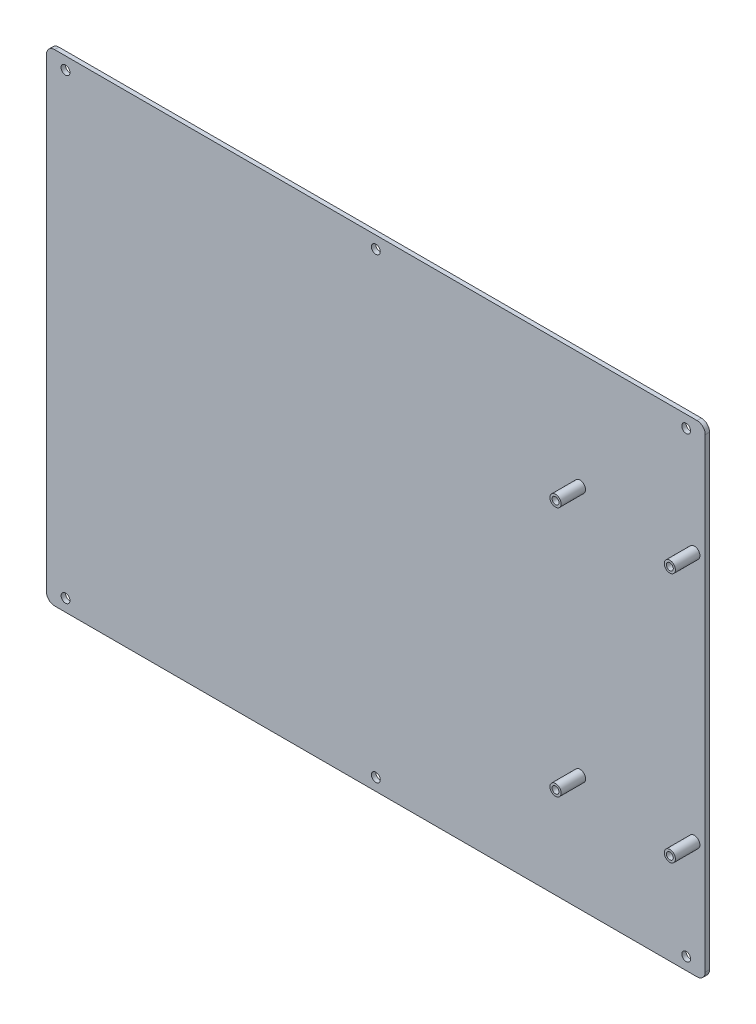
ISO-10303-21;
HEADER;
FILE_DESCRIPTION(('STEP AP214'),'2;1');
FILE_NAME('part.step','',(''),(''),'','','');
FILE_SCHEMA(('AUTOMOTIVE_DESIGN { 1 0 10303 214 1 1 1 1 }'));
ENDSEC;
DATA;
#1=APPLICATION_CONTEXT('core data for automotive mechanical design processes');
#2=APPLICATION_PROTOCOL_DEFINITION('international standard','automotive_design',2000,#1);
#3=PRODUCT_CONTEXT('',#1,'mechanical');
#4=PRODUCT('Part','Part','',(#3));
#5=PRODUCT_RELATED_PRODUCT_CATEGORY('part','',(#4));
#6=PRODUCT_DEFINITION_FORMATION('','',#4);
#7=PRODUCT_DEFINITION_CONTEXT('part definition',#1,'design');
#8=PRODUCT_DEFINITION('design','',#6,#7);
#9=PRODUCT_DEFINITION_SHAPE('','',#8);
#10=(LENGTH_UNIT() NAMED_UNIT(*) SI_UNIT(.MILLI.,.METRE.));
#11=(NAMED_UNIT(*) PLANE_ANGLE_UNIT() SI_UNIT($,.RADIAN.));
#12=(NAMED_UNIT(*) SI_UNIT($,.STERADIAN.) SOLID_ANGLE_UNIT());
#13=UNCERTAINTY_MEASURE_WITH_UNIT(LENGTH_MEASURE(1.E-05),#10,'distance_accuracy_value','');
#14=(GEOMETRIC_REPRESENTATION_CONTEXT(3) GLOBAL_UNCERTAINTY_ASSIGNED_CONTEXT((#13)) GLOBAL_UNIT_ASSIGNED_CONTEXT((#10,
#11,#12)) REPRESENTATION_CONTEXT('',''));
#15=CARTESIAN_POINT('',(0.,0.,0.));
#16=DIRECTION('',(0.,0.,1.));
#17=DIRECTION('',(1.,0.,0.));
#18=AXIS2_PLACEMENT_3D('',#15,#16,#17);
#19=CARTESIAN_POINT('',(0.,0.,0.));
#20=DIRECTION('',(0.,0.,1.));
#21=DIRECTION('',(1.,0.,0.));
#22=AXIS2_PLACEMENT_3D('',#19,#20,#21);
#23=PLANE('',#22);
#24=CARTESIAN_POINT('',(75.,46.0000000828811,0.));
#25=DIRECTION('',(0.,0.,-1.));
#26=DIRECTION('',(1.,0.,0.));
#27=AXIS2_PLACEMENT_3D('',#24,#25,#26);
#28=CIRCLE('',#27,2.05);
#29=CARTESIAN_POINT('',(72.95,46.0000000828811,0.));
#30=VERTEX_POINT('',#29);
#31=EDGE_CURVE('E204',#30,#30,#28,.T.);
#32=ORIENTED_EDGE('',*,*,#31,.F.);
#33=EDGE_LOOP('',(#32));
#34=FACE_BOUND('',#33,.T.);
#35=CARTESIAN_POINT('',(117.,-45.9999999171189,0.));
#36=DIRECTION('',(0.,0.,-1.));
#37=DIRECTION('',(1.,0.,0.));
#38=AXIS2_PLACEMENT_3D('',#35,#36,#37);
#39=CIRCLE('',#38,2.05);
#40=CARTESIAN_POINT('',(114.95,-45.9999999171189,0.));
#41=VERTEX_POINT('',#40);
#42=EDGE_CURVE('E239',#41,#41,#39,.T.);
#43=ORIENTED_EDGE('',*,*,#42,.F.);
#44=EDGE_LOOP('',(#43));
#45=FACE_BOUND('',#44,.T.);
#46=CARTESIAN_POINT('',(0.,84.,0.));
#47=DIRECTION('',(0.,0.,-1.));
#48=DIRECTION('',(1.,0.,0.));
#49=AXIS2_PLACEMENT_3D('',#46,#47,#48);
#50=CIRCLE('',#49,1.625);
#51=CARTESIAN_POINT('',(-1.625,84.,0.));
#52=VERTEX_POINT('',#51);
#53=EDGE_CURVE('E258',#52,#52,#50,.T.);
#54=ORIENTED_EDGE('',*,*,#53,.F.);
#55=EDGE_LOOP('',(#54));
#56=FACE_BOUND('',#55,.T.);
#57=CARTESIAN_POINT('',(-114.,84.,0.));
#58=DIRECTION('',(0.,0.,-1.));
#59=DIRECTION('',(1.,0.,0.));
#60=AXIS2_PLACEMENT_3D('',#57,#58,#59);
#61=CIRCLE('',#60,1.625);
#62=CARTESIAN_POINT('',(-115.625,84.,0.));
#63=VERTEX_POINT('',#62);
#64=EDGE_CURVE('E318',#63,#63,#61,.T.);
#65=ORIENTED_EDGE('',*,*,#64,.F.);
#66=EDGE_LOOP('',(#65));
#67=FACE_BOUND('',#66,.T.);
#68=CARTESIAN_POINT('',(117.,46.0000000828811,0.));
#69=DIRECTION('',(0.,0.,-1.));
#70=DIRECTION('',(1.,0.,0.));
#71=AXIS2_PLACEMENT_3D('',#68,#69,#70);
#72=CIRCLE('',#71,2.05);
#73=CARTESIAN_POINT('',(114.95,46.0000000828811,0.));
#74=VERTEX_POINT('',#73);
#75=EDGE_CURVE('E259',#74,#74,#72,.T.);
#76=ORIENTED_EDGE('',*,*,#75,.F.);
#77=EDGE_LOOP('',(#76));
#78=FACE_BOUND('',#77,.T.);
#79=CARTESIAN_POINT('',(0.,-83.9999998342378,0.));
#80=DIRECTION('',(0.,0.,-1.));
#81=DIRECTION('',(1.,0.,0.));
#82=AXIS2_PLACEMENT_3D('',#79,#80,#81);
#83=CIRCLE('',#82,1.625);
#84=CARTESIAN_POINT('',(-1.625,-83.9999998342378,0.));
#85=VERTEX_POINT('',#84);
#86=EDGE_CURVE('E228',#85,#85,#83,.T.);
#87=ORIENTED_EDGE('',*,*,#86,.F.);
#88=EDGE_LOOP('',(#87));
#89=FACE_BOUND('',#88,.T.);
#90=CARTESIAN_POINT('',(114.,84.,0.));
#91=DIRECTION('',(0.,0.,-1.));
#92=DIRECTION('',(1.,0.,0.));
#93=AXIS2_PLACEMENT_3D('',#90,#91,#92);
#94=CIRCLE('',#93,1.625);
#95=CARTESIAN_POINT('',(112.375,84.,0.));
#96=VERTEX_POINT('',#95);
#97=EDGE_CURVE('E164',#96,#96,#94,.T.);
#98=ORIENTED_EDGE('',*,*,#97,.F.);
#99=EDGE_LOOP('',(#98));
#100=FACE_BOUND('',#99,.T.);
#101=CARTESIAN_POINT('',(114.,-83.9999998342378,0.));
#102=DIRECTION('',(0.,0.,-1.));
#103=DIRECTION('',(1.,0.,0.));
#104=AXIS2_PLACEMENT_3D('',#101,#102,#103);
#105=CIRCLE('',#104,1.625);
#106=CARTESIAN_POINT('',(112.375,-83.9999998342378,0.));
#107=VERTEX_POINT('',#106);
#108=EDGE_CURVE('E175',#107,#107,#105,.T.);
#109=ORIENTED_EDGE('',*,*,#108,.F.);
#110=EDGE_LOOP('',(#109));
#111=FACE_BOUND('',#110,.T.);
#112=CARTESIAN_POINT('',(75.,-45.9999999171189,0.));
#113=DIRECTION('',(0.,0.,-1.));
#114=DIRECTION('',(1.,0.,0.));
#115=AXIS2_PLACEMENT_3D('',#112,#113,#114);
#116=CIRCLE('',#115,2.05);
#117=CARTESIAN_POINT('',(72.95,-45.9999999171189,0.));
#118=VERTEX_POINT('',#117);
#119=EDGE_CURVE('E222',#118,#118,#116,.T.);
#120=ORIENTED_EDGE('',*,*,#119,.F.);
#121=EDGE_LOOP('',(#120));
#122=FACE_BOUND('',#121,.T.);
#123=CARTESIAN_POINT('',(-114.,-83.9999998342378,0.));
#124=DIRECTION('',(0.,0.,-1.));
#125=DIRECTION('',(1.,0.,0.));
#126=AXIS2_PLACEMENT_3D('',#123,#124,#125);
#127=CIRCLE('',#126,1.625);
#128=CARTESIAN_POINT('',(-115.625,-83.9999998342378,0.));
#129=VERTEX_POINT('',#128);
#130=EDGE_CURVE('E214',#129,#129,#127,.T.);
#131=ORIENTED_EDGE('',*,*,#130,.F.);
#132=EDGE_LOOP('',(#131));
#133=FACE_BOUND('',#132,.T.);
#134=CARTESIAN_POINT('',(118.,85.5,0.));
#135=DIRECTION('',(0.,0.,1.));
#136=DIRECTION('',(1.,0.,0.));
#137=AXIS2_PLACEMENT_3D('',#134,#135,#136);
#138=CIRCLE('',#137,3.00000000000004);
#139=CARTESIAN_POINT('',(121.,85.5,0.));
#140=VERTEX_POINT('',#139);
#141=CARTESIAN_POINT('',(118.,88.5,0.));
#142=VERTEX_POINT('',#141);
#143=EDGE_CURVE('E27',#140,#142,#138,.T.);
#144=ORIENTED_EDGE('',*,*,#143,.F.);
#145=DIRECTION('',(0.,1.,0.));
#146=VECTOR('',#145,1.);
#147=CARTESIAN_POINT('',(121.,-85.5,0.));
#148=LINE('',#147,#146);
#149=CARTESIAN_POINT('',(121.,-85.5,0.));
#150=VERTEX_POINT('',#149);
#151=EDGE_CURVE('E211',#150,#140,#148,.T.);
#152=ORIENTED_EDGE('',*,*,#151,.F.);
#153=CARTESIAN_POINT('',(118.,-85.5,0.));
#154=DIRECTION('',(0.,0.,1.));
#155=DIRECTION('',(0.,-1.,0.));
#156=AXIS2_PLACEMENT_3D('',#153,#154,#155);
#157=CIRCLE('',#156,3.);
#158=CARTESIAN_POINT('',(118.,-88.5,0.));
#159=VERTEX_POINT('',#158);
#160=EDGE_CURVE('E246',#159,#150,#157,.T.);
#161=ORIENTED_EDGE('',*,*,#160,.F.);
#162=DIRECTION('',(1.,0.,0.));
#163=VECTOR('',#162,1.);
#164=CARTESIAN_POINT('',(-118.,-88.5,0.));
#165=LINE('',#164,#163);
#166=CARTESIAN_POINT('',(-118.,-88.5,0.));
#167=VERTEX_POINT('',#166);
#168=EDGE_CURVE('E422',#167,#159,#165,.T.);
#169=ORIENTED_EDGE('',*,*,#168,.F.);
#170=CARTESIAN_POINT('',(-118.,-85.5,0.));
#171=DIRECTION('',(0.,0.,1.));
#172=DIRECTION('',(-1.,0.,0.));
#173=AXIS2_PLACEMENT_3D('',#170,#171,#172);
#174=CIRCLE('',#173,3.);
#175=CARTESIAN_POINT('',(-121.,-85.5,0.));
#176=VERTEX_POINT('',#175);
#177=EDGE_CURVE('E65',#176,#167,#174,.T.);
#178=ORIENTED_EDGE('',*,*,#177,.F.);
#179=DIRECTION('',(0.,-1.,0.));
#180=VECTOR('',#179,1.);
#181=CARTESIAN_POINT('',(-121.,85.5,0.));
#182=LINE('',#181,#180);
#183=CARTESIAN_POINT('',(-121.,85.5,0.));
#184=VERTEX_POINT('',#183);
#185=EDGE_CURVE('E186',#184,#176,#182,.T.);
#186=ORIENTED_EDGE('',*,*,#185,.F.);
#187=CARTESIAN_POINT('',(-118.,85.5,0.));
#188=DIRECTION('',(0.,0.,1.));
#189=DIRECTION('',(0.,1.,0.));
#190=AXIS2_PLACEMENT_3D('',#187,#188,#189);
#191=CIRCLE('',#190,3.);
#192=CARTESIAN_POINT('',(-118.,88.5,0.));
#193=VERTEX_POINT('',#192);
#194=EDGE_CURVE('E311',#193,#184,#191,.T.);
#195=ORIENTED_EDGE('',*,*,#194,.F.);
#196=DIRECTION('',(-1.,0.,0.));
#197=VECTOR('',#196,1.);
#198=CARTESIAN_POINT('',(118.,88.5,0.));
#199=LINE('',#198,#197);
#200=EDGE_CURVE('E283',#142,#193,#199,.T.);
#201=ORIENTED_EDGE('',*,*,#200,.F.);
#202=EDGE_LOOP('',(#144,#152,#161,#169,#178,#186,#195,#201));
#203=FACE_BOUND('',#202,.T.);
#204=ADVANCED_FACE('F16',(#34,#45,#56,#67,#78,#89,#100,#111,#122,#133,#203),#23,.F.);
#205=CARTESIAN_POINT('',(0.,0.,1.5875));
#206=DIRECTION('',(0.,0.,1.));
#207=DIRECTION('',(1.,0.,0.));
#208=AXIS2_PLACEMENT_3D('',#205,#206,#207);
#209=PLANE('',#208);
#210=CARTESIAN_POINT('',(75.,46.0000000828811,1.5875));
#211=DIRECTION('',(0.,0.,-1.));
#212=DIRECTION('',(1.,0.,0.));
#213=AXIS2_PLACEMENT_3D('',#210,#211,#212);
#214=CIRCLE('',#213,2.05);
#215=CARTESIAN_POINT('',(72.95,46.0000000828811,1.5875));
#216=VERTEX_POINT('',#215);
#217=EDGE_CURVE('E176',#216,#216,#214,.T.);
#218=ORIENTED_EDGE('',*,*,#217,.T.);
#219=EDGE_LOOP('',(#218));
#220=FACE_BOUND('',#219,.T.);
#221=CARTESIAN_POINT('',(117.,-45.9999999171189,1.5875));
#222=DIRECTION('',(0.,0.,-1.));
#223=DIRECTION('',(1.,0.,0.));
#224=AXIS2_PLACEMENT_3D('',#221,#222,#223);
#225=CIRCLE('',#224,2.05);
#226=CARTESIAN_POINT('',(114.95,-45.9999999171189,1.5875));
#227=VERTEX_POINT('',#226);
#228=EDGE_CURVE('E162',#227,#227,#225,.T.);
#229=ORIENTED_EDGE('',*,*,#228,.T.);
#230=EDGE_LOOP('',(#229));
#231=FACE_BOUND('',#230,.T.);
#232=CARTESIAN_POINT('',(0.,84.,1.5875));
#233=DIRECTION('',(0.,0.,-1.));
#234=DIRECTION('',(1.,0.,0.));
#235=AXIS2_PLACEMENT_3D('',#232,#233,#234);
#236=CIRCLE('',#235,1.625);
#237=CARTESIAN_POINT('',(-1.625,84.,1.5875));
#238=VERTEX_POINT('',#237);
#239=EDGE_CURVE('E145',#238,#238,#236,.T.);
#240=ORIENTED_EDGE('',*,*,#239,.T.);
#241=EDGE_LOOP('',(#240));
#242=FACE_BOUND('',#241,.T.);
#243=CARTESIAN_POINT('',(-114.,84.,1.5875));
#244=DIRECTION('',(0.,0.,-1.));
#245=DIRECTION('',(1.,0.,0.));
#246=AXIS2_PLACEMENT_3D('',#243,#244,#245);
#247=CIRCLE('',#246,1.625);
#248=CARTESIAN_POINT('',(-115.625,84.,1.5875));
#249=VERTEX_POINT('',#248);
#250=EDGE_CURVE('E267',#249,#249,#247,.T.);
#251=ORIENTED_EDGE('',*,*,#250,.T.);
#252=EDGE_LOOP('',(#251));
#253=FACE_BOUND('',#252,.T.);
#254=CARTESIAN_POINT('',(117.,46.0000000828811,1.5875));
#255=DIRECTION('',(0.,0.,-1.));
#256=DIRECTION('',(1.,0.,0.));
#257=AXIS2_PLACEMENT_3D('',#254,#255,#256);
#258=CIRCLE('',#257,2.05);
#259=CARTESIAN_POINT('',(114.95,46.0000000828811,1.5875));
#260=VERTEX_POINT('',#259);
#261=EDGE_CURVE('E294',#260,#260,#258,.T.);
#262=ORIENTED_EDGE('',*,*,#261,.T.);
#263=EDGE_LOOP('',(#262));
#264=FACE_BOUND('',#263,.T.);
#265=CARTESIAN_POINT('',(0.,-83.9999998342378,1.5875));
#266=DIRECTION('',(0.,0.,-1.));
#267=DIRECTION('',(1.,0.,0.));
#268=AXIS2_PLACEMENT_3D('',#265,#266,#267);
#269=CIRCLE('',#268,1.625);
#270=CARTESIAN_POINT('',(-1.625,-83.9999998342378,1.5875));
#271=VERTEX_POINT('',#270);
#272=EDGE_CURVE('E229',#271,#271,#269,.T.);
#273=ORIENTED_EDGE('',*,*,#272,.T.);
#274=EDGE_LOOP('',(#273));
#275=FACE_BOUND('',#274,.T.);
#276=CARTESIAN_POINT('',(114.,84.,1.5875));
#277=DIRECTION('',(0.,0.,-1.));
#278=DIRECTION('',(1.,0.,0.));
#279=AXIS2_PLACEMENT_3D('',#276,#277,#278);
#280=CIRCLE('',#279,1.625);
#281=CARTESIAN_POINT('',(112.375,84.,1.5875));
#282=VERTEX_POINT('',#281);
#283=EDGE_CURVE('E20',#282,#282,#280,.T.);
#284=ORIENTED_EDGE('',*,*,#283,.T.);
#285=EDGE_LOOP('',(#284));
#286=FACE_BOUND('',#285,.T.);
#287=CARTESIAN_POINT('',(114.,-83.9999998342378,1.5875));
#288=DIRECTION('',(0.,0.,-1.));
#289=DIRECTION('',(1.,0.,0.));
#290=AXIS2_PLACEMENT_3D('',#287,#288,#289);
#291=CIRCLE('',#290,1.625);
#292=CARTESIAN_POINT('',(112.375,-83.9999998342378,1.5875));
#293=VERTEX_POINT('',#292);
#294=EDGE_CURVE('E168',#293,#293,#291,.T.);
#295=ORIENTED_EDGE('',*,*,#294,.T.);
#296=EDGE_LOOP('',(#295));
#297=FACE_BOUND('',#296,.T.);
#298=CARTESIAN_POINT('',(75.,-45.9999999171189,1.5875));
#299=DIRECTION('',(0.,0.,-1.));
#300=DIRECTION('',(1.,0.,0.));
#301=AXIS2_PLACEMENT_3D('',#298,#299,#300);
#302=CIRCLE('',#301,2.05);
#303=CARTESIAN_POINT('',(72.95,-45.9999999171189,1.5875));
#304=VERTEX_POINT('',#303);
#305=EDGE_CURVE('E150',#304,#304,#302,.T.);
#306=ORIENTED_EDGE('',*,*,#305,.T.);
#307=EDGE_LOOP('',(#306));
#308=FACE_BOUND('',#307,.T.);
#309=CARTESIAN_POINT('',(-114.,-83.9999998342378,1.5875));
#310=DIRECTION('',(0.,0.,-1.));
#311=DIRECTION('',(1.,0.,0.));
#312=AXIS2_PLACEMENT_3D('',#309,#310,#311);
#313=CIRCLE('',#312,1.625);
#314=CARTESIAN_POINT('',(-115.625,-83.9999998342378,1.5875));
#315=VERTEX_POINT('',#314);
#316=EDGE_CURVE('E170',#315,#315,#313,.T.);
#317=ORIENTED_EDGE('',*,*,#316,.T.);
#318=EDGE_LOOP('',(#317));
#319=FACE_BOUND('',#318,.T.);
#320=CARTESIAN_POINT('',(118.,85.5,1.5875));
#321=DIRECTION('',(0.,0.,1.));
#322=DIRECTION('',(1.,0.,0.));
#323=AXIS2_PLACEMENT_3D('',#320,#321,#322);
#324=CIRCLE('',#323,3.00000000000004);
#325=CARTESIAN_POINT('',(121.,85.5,1.5875));
#326=VERTEX_POINT('',#325);
#327=CARTESIAN_POINT('',(118.,88.5,1.5875));
#328=VERTEX_POINT('',#327);
#329=EDGE_CURVE('E11',#326,#328,#324,.T.);
#330=ORIENTED_EDGE('',*,*,#329,.T.);
#331=DIRECTION('',(-1.,0.,0.));
#332=VECTOR('',#331,1.);
#333=CARTESIAN_POINT('',(118.,88.5,1.5875));
#334=LINE('',#333,#332);
#335=CARTESIAN_POINT('',(-118.,88.5,1.5875));
#336=VERTEX_POINT('',#335);
#337=EDGE_CURVE('E331',#328,#336,#334,.T.);
#338=ORIENTED_EDGE('',*,*,#337,.T.);
#339=CARTESIAN_POINT('',(-118.,85.5,1.5875));
#340=DIRECTION('',(0.,0.,1.));
#341=DIRECTION('',(0.,1.,0.));
#342=AXIS2_PLACEMENT_3D('',#339,#340,#341);
#343=CIRCLE('',#342,3.);
#344=CARTESIAN_POINT('',(-121.,85.5,1.5875));
#345=VERTEX_POINT('',#344);
#346=EDGE_CURVE('E284',#336,#345,#343,.T.);
#347=ORIENTED_EDGE('',*,*,#346,.T.);
#348=DIRECTION('',(0.,-1.,0.));
#349=VECTOR('',#348,1.);
#350=CARTESIAN_POINT('',(-121.,85.5,1.5875));
#351=LINE('',#350,#349);
#352=CARTESIAN_POINT('',(-121.,-85.5,1.5875));
#353=VERTEX_POINT('',#352);
#354=EDGE_CURVE('E218',#345,#353,#351,.T.);
#355=ORIENTED_EDGE('',*,*,#354,.T.);
#356=CARTESIAN_POINT('',(-118.,-85.5,1.5875));
#357=DIRECTION('',(0.,0.,1.));
#358=DIRECTION('',(-1.,0.,0.));
#359=AXIS2_PLACEMENT_3D('',#356,#357,#358);
#360=CIRCLE('',#359,3.);
#361=CARTESIAN_POINT('',(-118.,-88.5,1.5875));
#362=VERTEX_POINT('',#361);
#363=EDGE_CURVE('E76',#353,#362,#360,.T.);
#364=ORIENTED_EDGE('',*,*,#363,.T.);
#365=DIRECTION('',(1.,0.,0.));
#366=VECTOR('',#365,1.);
#367=CARTESIAN_POINT('',(-118.,-88.5,1.5875));
#368=LINE('',#367,#366);
#369=CARTESIAN_POINT('',(118.,-88.5,1.5875));
#370=VERTEX_POINT('',#369);
#371=EDGE_CURVE('E427',#362,#370,#368,.T.);
#372=ORIENTED_EDGE('',*,*,#371,.T.);
#373=CARTESIAN_POINT('',(118.,-85.5,1.5875));
#374=DIRECTION('',(0.,0.,1.));
#375=DIRECTION('',(0.,-1.,0.));
#376=AXIS2_PLACEMENT_3D('',#373,#374,#375);
#377=CIRCLE('',#376,3.);
#378=CARTESIAN_POINT('',(121.,-85.5,1.5875));
#379=VERTEX_POINT('',#378);
#380=EDGE_CURVE('E250',#370,#379,#377,.T.);
#381=ORIENTED_EDGE('',*,*,#380,.T.);
#382=DIRECTION('',(0.,1.,0.));
#383=VECTOR('',#382,1.);
#384=CARTESIAN_POINT('',(121.,-85.5,1.5875));
#385=LINE('',#384,#383);
#386=EDGE_CURVE('E206',#379,#326,#385,.T.);
#387=ORIENTED_EDGE('',*,*,#386,.T.);
#388=EDGE_LOOP('',(#330,#338,#347,#355,#364,#372,#381,#387));
#389=FACE_BOUND('',#388,.T.);
#390=ADVANCED_FACE('F354',(#220,#231,#242,#253,#264,#275,#286,#297,#308,#319,#389),#209,.T.);
#391=CARTESIAN_POINT('',(118.,85.5,0.));
#392=DIRECTION('',(0.,0.,1.));
#393=DIRECTION('',(1.,0.,0.));
#394=AXIS2_PLACEMENT_3D('',#391,#392,#393);
#395=CYLINDRICAL_SURFACE('',#394,3.00000000000004);
#396=ORIENTED_EDGE('',*,*,#143,.T.);
#397=DIRECTION('',(0.,0.,1.));
#398=VECTOR('',#397,1.);
#399=CARTESIAN_POINT('',(118.,88.5,0.));
#400=LINE('',#399,#398);
#401=EDGE_CURVE('E327',#142,#328,#400,.T.);
#402=ORIENTED_EDGE('',*,*,#401,.T.);
#403=ORIENTED_EDGE('',*,*,#329,.F.);
#404=DIRECTION('',(0.,0.,1.));
#405=VECTOR('',#404,1.);
#406=CARTESIAN_POINT('',(121.,85.5,0.));
#407=LINE('',#406,#405);
#408=EDGE_CURVE('E209',#140,#326,#407,.T.);
#409=ORIENTED_EDGE('',*,*,#408,.F.);
#410=EDGE_LOOP('',(#396,#402,#403,#409));
#411=FACE_BOUND('',#410,.T.);
#412=ADVANCED_FACE('F569',(#411),#395,.T.);
#413=CARTESIAN_POINT('',(118.,88.5,0.));
#414=DIRECTION('',(0.,1.,0.));
#415=DIRECTION('',(1.,0.,0.));
#416=AXIS2_PLACEMENT_3D('',#413,#414,#415);
#417=PLANE('',#416);
#418=ORIENTED_EDGE('',*,*,#200,.T.);
#419=DIRECTION('',(0.,0.,1.));
#420=VECTOR('',#419,1.);
#421=CARTESIAN_POINT('',(-118.,88.5,0.));
#422=LINE('',#421,#420);
#423=EDGE_CURVE('E280',#193,#336,#422,.T.);
#424=ORIENTED_EDGE('',*,*,#423,.T.);
#425=ORIENTED_EDGE('',*,*,#337,.F.);
#426=ORIENTED_EDGE('',*,*,#401,.F.);
#427=EDGE_LOOP('',(#418,#424,#425,#426));
#428=FACE_BOUND('',#427,.T.);
#429=ADVANCED_FACE('F576',(#428),#417,.T.);
#430=CARTESIAN_POINT('',(-118.,85.5,0.));
#431=DIRECTION('',(0.,0.,1.));
#432=DIRECTION('',(0.,1.,0.));
#433=AXIS2_PLACEMENT_3D('',#430,#431,#432);
#434=CYLINDRICAL_SURFACE('',#433,3.);
#435=ORIENTED_EDGE('',*,*,#194,.T.);
#436=DIRECTION('',(0.,0.,1.));
#437=VECTOR('',#436,1.);
#438=CARTESIAN_POINT('',(-121.,85.5,0.));
#439=LINE('',#438,#437);
#440=EDGE_CURVE('E242',#184,#345,#439,.T.);
#441=ORIENTED_EDGE('',*,*,#440,.T.);
#442=ORIENTED_EDGE('',*,*,#346,.F.);
#443=ORIENTED_EDGE('',*,*,#423,.F.);
#444=EDGE_LOOP('',(#435,#441,#442,#443));
#445=FACE_BOUND('',#444,.T.);
#446=ADVANCED_FACE('F605',(#445),#434,.T.);
#447=CARTESIAN_POINT('',(-121.,85.5,0.));
#448=DIRECTION('',(-1.,0.,0.));
#449=DIRECTION('',(0.,0.,1.));
#450=AXIS2_PLACEMENT_3D('',#447,#448,#449);
#451=PLANE('',#450);
#452=ORIENTED_EDGE('',*,*,#185,.T.);
#453=DIRECTION('',(0.,0.,1.));
#454=VECTOR('',#453,1.);
#455=CARTESIAN_POINT('',(-121.,-85.5,0.));
#456=LINE('',#455,#454);
#457=EDGE_CURVE('E182',#176,#353,#456,.T.);
#458=ORIENTED_EDGE('',*,*,#457,.T.);
#459=ORIENTED_EDGE('',*,*,#354,.F.);
#460=ORIENTED_EDGE('',*,*,#440,.F.);
#461=EDGE_LOOP('',(#452,#458,#459,#460));
#462=FACE_BOUND('',#461,.T.);
#463=ADVANCED_FACE('F599',(#462),#451,.T.);
#464=CARTESIAN_POINT('',(-118.,-85.5,0.));
#465=DIRECTION('',(0.,0.,1.));
#466=DIRECTION('',(-1.,0.,0.));
#467=AXIS2_PLACEMENT_3D('',#464,#465,#466);
#468=CYLINDRICAL_SURFACE('',#467,3.);
#469=ORIENTED_EDGE('',*,*,#177,.T.);
#470=DIRECTION('',(0.,0.,1.));
#471=VECTOR('',#470,1.);
#472=CARTESIAN_POINT('',(-118.,-88.5,0.));
#473=LINE('',#472,#471);
#474=EDGE_CURVE('E199',#167,#362,#473,.T.);
#475=ORIENTED_EDGE('',*,*,#474,.T.);
#476=ORIENTED_EDGE('',*,*,#363,.F.);
#477=ORIENTED_EDGE('',*,*,#457,.F.);
#478=EDGE_LOOP('',(#469,#475,#476,#477));
#479=FACE_BOUND('',#478,.T.);
#480=ADVANCED_FACE('F597',(#479),#468,.T.);
#481=CARTESIAN_POINT('',(-118.,-88.5,0.));
#482=DIRECTION('',(0.,-1.,0.));
#483=DIRECTION('',(0.,0.,-1.));
#484=AXIS2_PLACEMENT_3D('',#481,#482,#483);
#485=PLANE('',#484);
#486=ORIENTED_EDGE('',*,*,#168,.T.);
#487=DIRECTION('',(0.,0.,1.));
#488=VECTOR('',#487,1.);
#489=CARTESIAN_POINT('',(118.,-88.5,0.));
#490=LINE('',#489,#488);
#491=EDGE_CURVE('E289',#159,#370,#490,.T.);
#492=ORIENTED_EDGE('',*,*,#491,.T.);
#493=ORIENTED_EDGE('',*,*,#371,.F.);
#494=ORIENTED_EDGE('',*,*,#474,.F.);
#495=EDGE_LOOP('',(#486,#492,#493,#494));
#496=FACE_BOUND('',#495,.T.);
#497=ADVANCED_FACE('F423',(#496),#485,.T.);
#498=CARTESIAN_POINT('',(118.,-85.5,0.));
#499=DIRECTION('',(0.,0.,1.));
#500=DIRECTION('',(0.,-1.,0.));
#501=AXIS2_PLACEMENT_3D('',#498,#499,#500);
#502=CYLINDRICAL_SURFACE('',#501,3.);
#503=ORIENTED_EDGE('',*,*,#160,.T.);
#504=DIRECTION('',(0.,0.,1.));
#505=VECTOR('',#504,1.);
#506=CARTESIAN_POINT('',(121.,-85.5,0.));
#507=LINE('',#506,#505);
#508=EDGE_CURVE('E208',#150,#379,#507,.T.);
#509=ORIENTED_EDGE('',*,*,#508,.T.);
#510=ORIENTED_EDGE('',*,*,#380,.F.);
#511=ORIENTED_EDGE('',*,*,#491,.F.);
#512=EDGE_LOOP('',(#503,#509,#510,#511));
#513=FACE_BOUND('',#512,.T.);
#514=ADVANCED_FACE('F344',(#513),#502,.T.);
#515=CARTESIAN_POINT('',(121.,-85.5,0.));
#516=DIRECTION('',(1.,0.,0.));
#517=DIRECTION('',(0.,1.,0.));
#518=AXIS2_PLACEMENT_3D('',#515,#516,#517);
#519=PLANE('',#518);
#520=ORIENTED_EDGE('',*,*,#151,.T.);
#521=ORIENTED_EDGE('',*,*,#408,.T.);
#522=ORIENTED_EDGE('',*,*,#386,.F.);
#523=ORIENTED_EDGE('',*,*,#508,.F.);
#524=EDGE_LOOP('',(#520,#521,#522,#523));
#525=FACE_BOUND('',#524,.T.);
#526=ADVANCED_FACE('F352',(#525),#519,.T.);
#527=CARTESIAN_POINT('',(-114.,-83.9999998342378,0.));
#528=DIRECTION('',(0.,0.,1.));
#529=DIRECTION('',(1.,0.,0.));
#530=AXIS2_PLACEMENT_3D('',#527,#528,#529);
#531=CYLINDRICAL_SURFACE('',#530,1.625);
#532=ORIENTED_EDGE('',*,*,#316,.F.);
#533=DIRECTION('',(0.,0.,-1.));
#534=VECTOR('',#533,1.);
#535=CARTESIAN_POINT('',(-115.625,-83.9999998342378,0.));
#536=LINE('',#535,#534);
#537=EDGE_CURVE('E174',#315,#129,#536,.T.);
#538=ORIENTED_EDGE('',*,*,#537,.T.);
#539=ORIENTED_EDGE('',*,*,#130,.T.);
#540=ORIENTED_EDGE('',*,*,#537,.F.);
#541=EDGE_LOOP('',(#532,#538,#539,#540));
#542=FACE_BOUND('',#541,.T.);
#543=ADVANCED_FACE('F566',(#542),#531,.F.);
#544=CARTESIAN_POINT('',(114.,-83.9999998342378,0.));
#545=DIRECTION('',(0.,0.,1.));
#546=DIRECTION('',(1.,0.,0.));
#547=AXIS2_PLACEMENT_3D('',#544,#545,#546);
#548=CYLINDRICAL_SURFACE('',#547,1.625);
#549=ORIENTED_EDGE('',*,*,#294,.F.);
#550=DIRECTION('',(0.,0.,-1.));
#551=VECTOR('',#550,1.);
#552=CARTESIAN_POINT('',(112.375,-83.9999998342378,0.));
#553=LINE('',#552,#551);
#554=EDGE_CURVE('E233',#293,#107,#553,.T.);
#555=ORIENTED_EDGE('',*,*,#554,.T.);
#556=ORIENTED_EDGE('',*,*,#108,.T.);
#557=ORIENTED_EDGE('',*,*,#554,.F.);
#558=EDGE_LOOP('',(#549,#555,#556,#557));
#559=FACE_BOUND('',#558,.T.);
#560=ADVANCED_FACE('F595',(#559),#548,.F.);
#561=CARTESIAN_POINT('',(114.,84.,0.));
#562=DIRECTION('',(0.,0.,1.));
#563=DIRECTION('',(1.,0.,0.));
#564=AXIS2_PLACEMENT_3D('',#561,#562,#563);
#565=CYLINDRICAL_SURFACE('',#564,1.625);
#566=ORIENTED_EDGE('',*,*,#283,.F.);
#567=DIRECTION('',(0.,0.,-1.));
#568=VECTOR('',#567,1.);
#569=CARTESIAN_POINT('',(112.375,84.,0.));
#570=LINE('',#569,#568);
#571=EDGE_CURVE('E169',#282,#96,#570,.T.);
#572=ORIENTED_EDGE('',*,*,#571,.T.);
#573=ORIENTED_EDGE('',*,*,#97,.T.);
#574=ORIENTED_EDGE('',*,*,#571,.F.);
#575=EDGE_LOOP('',(#566,#572,#573,#574));
#576=FACE_BOUND('',#575,.T.);
#577=ADVANCED_FACE('F592',(#576),#565,.F.);
#578=CARTESIAN_POINT('',(0.,-83.9999998342378,0.));
#579=DIRECTION('',(0.,0.,1.));
#580=DIRECTION('',(1.,0.,0.));
#581=AXIS2_PLACEMENT_3D('',#578,#579,#580);
#582=CYLINDRICAL_SURFACE('',#581,1.625);
#583=ORIENTED_EDGE('',*,*,#272,.F.);
#584=DIRECTION('',(0.,0.,-1.));
#585=VECTOR('',#584,1.);
#586=CARTESIAN_POINT('',(-1.625,-83.9999998342378,0.));
#587=LINE('',#586,#585);
#588=EDGE_CURVE('E224',#271,#85,#587,.T.);
#589=ORIENTED_EDGE('',*,*,#588,.T.);
#590=ORIENTED_EDGE('',*,*,#86,.T.);
#591=ORIENTED_EDGE('',*,*,#588,.F.);
#592=EDGE_LOOP('',(#583,#589,#590,#591));
#593=FACE_BOUND('',#592,.T.);
#594=ADVANCED_FACE('F588',(#593),#582,.F.);
#595=CARTESIAN_POINT('',(-114.,84.,0.));
#596=DIRECTION('',(0.,0.,1.));
#597=DIRECTION('',(1.,0.,0.));
#598=AXIS2_PLACEMENT_3D('',#595,#596,#597);
#599=CYLINDRICAL_SURFACE('',#598,1.625);
#600=ORIENTED_EDGE('',*,*,#250,.F.);
#601=DIRECTION('',(0.,0.,-1.));
#602=VECTOR('',#601,1.);
#603=CARTESIAN_POINT('',(-115.625,84.,0.));
#604=LINE('',#603,#602);
#605=EDGE_CURVE('E271',#249,#63,#604,.T.);
#606=ORIENTED_EDGE('',*,*,#605,.T.);
#607=ORIENTED_EDGE('',*,*,#64,.T.);
#608=ORIENTED_EDGE('',*,*,#605,.F.);
#609=EDGE_LOOP('',(#600,#606,#607,#608));
#610=FACE_BOUND('',#609,.T.);
#611=ADVANCED_FACE('F591',(#610),#599,.F.);
#612=CARTESIAN_POINT('',(0.,84.,0.));
#613=DIRECTION('',(0.,0.,1.));
#614=DIRECTION('',(1.,0.,0.));
#615=AXIS2_PLACEMENT_3D('',#612,#613,#614);
#616=CYLINDRICAL_SURFACE('',#615,1.625);
#617=ORIENTED_EDGE('',*,*,#239,.F.);
#618=DIRECTION('',(0.,0.,-1.));
#619=VECTOR('',#618,1.);
#620=CARTESIAN_POINT('',(-1.625,84.,0.));
#621=LINE('',#620,#619);
#622=EDGE_CURVE('E254',#238,#52,#621,.T.);
#623=ORIENTED_EDGE('',*,*,#622,.T.);
#624=ORIENTED_EDGE('',*,*,#53,.T.);
#625=ORIENTED_EDGE('',*,*,#622,.F.);
#626=EDGE_LOOP('',(#617,#623,#624,#625));
#627=FACE_BOUND('',#626,.T.);
#628=ADVANCED_FACE('F640',(#627),#616,.F.);
#629=CARTESIAN_POINT('',(96.,8.28811330677581E-08,10.5875));
#630=DIRECTION('',(0.,0.,1.));
#631=DIRECTION('',(1.,0.,0.));
#632=AXIS2_PLACEMENT_3D('',#629,#630,#631);
#633=PLANE('',#632);
#634=CARTESIAN_POINT('',(75.,-45.9999999171189,10.5875));
#635=DIRECTION('',(0.,0.,-1.));
#636=DIRECTION('',(1.,0.,0.));
#637=AXIS2_PLACEMENT_3D('',#634,#635,#636);
#638=CIRCLE('',#637,1.2645);
#639=CARTESIAN_POINT('',(73.7355,-45.9999999171189,10.5875));
#640=VERTEX_POINT('',#639);
#641=EDGE_CURVE('E143',#640,#640,#638,.T.);
#642=ORIENTED_EDGE('',*,*,#641,.T.);
#643=EDGE_LOOP('',(#642));
#644=FACE_BOUND('',#643,.T.);
#645=CARTESIAN_POINT('',(75.,-45.9999999171189,10.5875));
#646=DIRECTION('',(0.,0.,1.));
#647=DIRECTION('',(1.,0.,0.));
#648=AXIS2_PLACEMENT_3D('',#645,#646,#647);
#649=CIRCLE('',#648,2.05);
#650=CARTESIAN_POINT('',(72.95,-45.9999999171189,10.5875));
#651=VERTEX_POINT('',#650);
#652=EDGE_CURVE('E332',#651,#651,#649,.T.);
#653=ORIENTED_EDGE('',*,*,#652,.T.);
#654=EDGE_LOOP('',(#653));
#655=FACE_BOUND('',#654,.T.);
#656=ADVANCED_FACE('F622',(#644,#655),#633,.T.);
#657=CARTESIAN_POINT('',(75.,-45.9999999171189,1.5875));
#658=DIRECTION('',(0.,0.,1.));
#659=DIRECTION('',(1.,0.,0.));
#660=AXIS2_PLACEMENT_3D('',#657,#658,#659);
#661=CYLINDRICAL_SURFACE('',#660,1.2645);
#662=ORIENTED_EDGE('',*,*,#641,.F.);
#663=DIRECTION('',(0.,0.,-1.));
#664=VECTOR('',#663,1.);
#665=CARTESIAN_POINT('',(73.7355,-45.9999999171189,1.5875));
#666=LINE('',#665,#664);
#667=CARTESIAN_POINT('',(73.7355,-45.9999999171189,-0.000500000000000222));
#668=VERTEX_POINT('',#667);
#669=EDGE_CURVE('E138',#640,#668,#666,.T.);
#670=ORIENTED_EDGE('',*,*,#669,.T.);
#671=CARTESIAN_POINT('',(75.,-45.9999999171189,-0.000500000000000222));
#672=DIRECTION('',(0.,0.,1.));
#673=DIRECTION('',(1.,0.,0.));
#674=AXIS2_PLACEMENT_3D('',#671,#672,#673);
#675=CIRCLE('',#674,1.2645);
#676=EDGE_CURVE('E141',#668,#668,#675,.T.);
#677=ORIENTED_EDGE('',*,*,#676,.F.);
#678=ORIENTED_EDGE('',*,*,#669,.F.);
#679=EDGE_LOOP('',(#662,#670,#677,#678));
#680=FACE_BOUND('',#679,.T.);
#681=ADVANCED_FACE('F140',(#680),#661,.F.);
#682=CARTESIAN_POINT('',(96.,8.28811330677581E-08,-0.000500000000000222));
#683=DIRECTION('',(0.,0.,1.));
#684=DIRECTION('',(1.,0.,0.));
#685=AXIS2_PLACEMENT_3D('',#682,#683,#684);
#686=PLANE('',#685);
#687=ORIENTED_EDGE('',*,*,#676,.T.);
#688=EDGE_LOOP('',(#687));
#689=FACE_BOUND('',#688,.T.);
#690=CARTESIAN_POINT('',(75.,-45.9999999171189,-0.000500000000000222));
#691=DIRECTION('',(0.,0.,-1.));
#692=DIRECTION('',(1.,0.,0.));
#693=AXIS2_PLACEMENT_3D('',#690,#691,#692);
#694=CIRCLE('',#693,2.05);
#695=CARTESIAN_POINT('',(72.95,-45.9999999171189,-0.000500000000000222));
#696=VERTEX_POINT('',#695);
#697=EDGE_CURVE('E303',#696,#696,#694,.T.);
#698=ORIENTED_EDGE('',*,*,#697,.T.);
#699=EDGE_LOOP('',(#698));
#700=FACE_BOUND('',#699,.T.);
#701=ADVANCED_FACE('F18',(#689,#700),#686,.F.);
#702=CARTESIAN_POINT('',(75.,-45.9999999171189,1.5875));
#703=DIRECTION('',(0.,0.,1.));
#704=DIRECTION('',(1.,0.,0.));
#705=AXIS2_PLACEMENT_3D('',#702,#703,#704);
#706=CYLINDRICAL_SURFACE('',#705,2.05);
#707=ORIENTED_EDGE('',*,*,#652,.F.);
#708=DIRECTION('',(0.,0.,-1.));
#709=VECTOR('',#708,1.);
#710=CARTESIAN_POINT('',(72.95,-45.9999999171189,1.5875));
#711=LINE('',#710,#709);
#712=EDGE_CURVE('E158',#651,#304,#711,.T.);
#713=ORIENTED_EDGE('',*,*,#712,.T.);
#714=ORIENTED_EDGE('',*,*,#305,.F.);
#715=ORIENTED_EDGE('',*,*,#712,.F.);
#716=EDGE_LOOP('',(#707,#713,#714,#715));
#717=FACE_BOUND('',#716,.T.);
#718=ADVANCED_FACE('F619',(#717),#706,.T.);
#719=CARTESIAN_POINT('',(75.,-45.9999999171189,1.5875));
#720=DIRECTION('',(0.,0.,1.));
#721=DIRECTION('',(1.,0.,0.));
#722=AXIS2_PLACEMENT_3D('',#719,#720,#721);
#723=CYLINDRICAL_SURFACE('',#722,2.05);
#724=ORIENTED_EDGE('',*,*,#119,.T.);
#725=DIRECTION('',(0.,0.,-1.));
#726=VECTOR('',#725,1.);
#727=CARTESIAN_POINT('',(72.95,-45.9999999171189,1.5875));
#728=LINE('',#727,#726);
#729=EDGE_CURVE('E299',#118,#696,#728,.T.);
#730=ORIENTED_EDGE('',*,*,#729,.T.);
#731=ORIENTED_EDGE('',*,*,#697,.F.);
#732=ORIENTED_EDGE('',*,*,#729,.F.);
#733=EDGE_LOOP('',(#724,#730,#731,#732));
#734=FACE_BOUND('',#733,.T.);
#735=ADVANCED_FACE('F615',(#734),#723,.T.);
#736=CARTESIAN_POINT('',(96.,8.28811330677581E-08,10.5875));
#737=DIRECTION('',(0.,0.,1.));
#738=DIRECTION('',(1.,0.,0.));
#739=AXIS2_PLACEMENT_3D('',#736,#737,#738);
#740=PLANE('',#739);
#741=CARTESIAN_POINT('',(117.,-45.9999999171189,10.5875));
#742=DIRECTION('',(0.,0.,-1.));
#743=DIRECTION('',(1.,0.,0.));
#744=AXIS2_PLACEMENT_3D('',#741,#742,#743);
#745=CIRCLE('',#744,1.2645);
#746=CARTESIAN_POINT('',(115.7355,-45.9999999171189,10.5875));
#747=VERTEX_POINT('',#746);
#748=EDGE_CURVE('E223',#747,#747,#745,.T.);
#749=ORIENTED_EDGE('',*,*,#748,.T.);
#750=EDGE_LOOP('',(#749));
#751=FACE_BOUND('',#750,.T.);
#752=CARTESIAN_POINT('',(117.,-45.9999999171189,10.5875));
#753=DIRECTION('',(0.,0.,1.));
#754=DIRECTION('',(1.,0.,0.));
#755=AXIS2_PLACEMENT_3D('',#752,#753,#754);
#756=CIRCLE('',#755,2.05);
#757=CARTESIAN_POINT('',(114.95,-45.9999999171189,10.5875));
#758=VERTEX_POINT('',#757);
#759=EDGE_CURVE('E196',#758,#758,#756,.T.);
#760=ORIENTED_EDGE('',*,*,#759,.T.);
#761=EDGE_LOOP('',(#760));
#762=FACE_BOUND('',#761,.T.);
#763=ADVANCED_FACE('F618',(#751,#762),#740,.T.);
#764=CARTESIAN_POINT('',(117.,-45.9999999171189,1.5875));
#765=DIRECTION('',(0.,0.,1.));
#766=DIRECTION('',(1.,0.,0.));
#767=AXIS2_PLACEMENT_3D('',#764,#765,#766);
#768=CYLINDRICAL_SURFACE('',#767,1.2645);
#769=ORIENTED_EDGE('',*,*,#748,.F.);
#770=DIRECTION('',(0.,0.,-1.));
#771=VECTOR('',#770,1.);
#772=CARTESIAN_POINT('',(115.7355,-45.9999999171189,1.5875));
#773=LINE('',#772,#771);
#774=CARTESIAN_POINT('',(115.7355,-45.9999999171189,-0.000500000000000222));
#775=VERTEX_POINT('',#774);
#776=EDGE_CURVE('E219',#747,#775,#773,.T.);
#777=ORIENTED_EDGE('',*,*,#776,.T.);
#778=CARTESIAN_POINT('',(117.,-45.9999999171189,-0.000500000000000222));
#779=DIRECTION('',(0.,0.,1.));
#780=DIRECTION('',(1.,0.,0.));
#781=AXIS2_PLACEMENT_3D('',#778,#779,#780);
#782=CIRCLE('',#781,1.2645);
#783=EDGE_CURVE('E508',#775,#775,#782,.T.);
#784=ORIENTED_EDGE('',*,*,#783,.F.);
#785=ORIENTED_EDGE('',*,*,#776,.F.);
#786=EDGE_LOOP('',(#769,#777,#784,#785));
#787=FACE_BOUND('',#786,.T.);
#788=ADVANCED_FACE('F656',(#787),#768,.F.);
#789=CARTESIAN_POINT('',(96.,8.28811330677581E-08,-0.000500000000000222));
#790=DIRECTION('',(0.,0.,1.));
#791=DIRECTION('',(1.,0.,0.));
#792=AXIS2_PLACEMENT_3D('',#789,#790,#791);
#793=PLANE('',#792);
#794=ORIENTED_EDGE('',*,*,#783,.T.);
#795=EDGE_LOOP('',(#794));
#796=FACE_BOUND('',#795,.T.);
#797=CARTESIAN_POINT('',(117.,-45.9999999171189,-0.000500000000000222));
#798=DIRECTION('',(0.,0.,-1.));
#799=DIRECTION('',(1.,0.,0.));
#800=AXIS2_PLACEMENT_3D('',#797,#798,#799);
#801=CIRCLE('',#800,2.05);
#802=CARTESIAN_POINT('',(114.95,-45.9999999171189,-0.000500000000000222));
#803=VERTEX_POINT('',#802);
#804=EDGE_CURVE('E238',#803,#803,#801,.T.);
#805=ORIENTED_EDGE('',*,*,#804,.T.);
#806=EDGE_LOOP('',(#805));
#807=FACE_BOUND('',#806,.T.);
#808=ADVANCED_FACE('F653',(#796,#807),#793,.F.);
#809=CARTESIAN_POINT('',(117.,-45.9999999171189,1.5875));
#810=DIRECTION('',(0.,0.,1.));
#811=DIRECTION('',(1.,0.,0.));
#812=AXIS2_PLACEMENT_3D('',#809,#810,#811);
#813=CYLINDRICAL_SURFACE('',#812,2.05);
#814=ORIENTED_EDGE('',*,*,#759,.F.);
#815=DIRECTION('',(0.,0.,-1.));
#816=VECTOR('',#815,1.);
#817=CARTESIAN_POINT('',(114.95,-45.9999999171189,1.5875));
#818=LINE('',#817,#816);
#819=EDGE_CURVE('E192',#758,#227,#818,.T.);
#820=ORIENTED_EDGE('',*,*,#819,.T.);
#821=ORIENTED_EDGE('',*,*,#228,.F.);
#822=ORIENTED_EDGE('',*,*,#819,.F.);
#823=EDGE_LOOP('',(#814,#820,#821,#822));
#824=FACE_BOUND('',#823,.T.);
#825=ADVANCED_FACE('F651',(#824),#813,.T.);
#826=CARTESIAN_POINT('',(117.,-45.9999999171189,1.5875));
#827=DIRECTION('',(0.,0.,1.));
#828=DIRECTION('',(1.,0.,0.));
#829=AXIS2_PLACEMENT_3D('',#826,#827,#828);
#830=CYLINDRICAL_SURFACE('',#829,2.05);
#831=ORIENTED_EDGE('',*,*,#42,.T.);
#832=DIRECTION('',(0.,0.,-1.));
#833=VECTOR('',#832,1.);
#834=CARTESIAN_POINT('',(114.95,-45.9999999171189,1.5875));
#835=LINE('',#834,#833);
#836=EDGE_CURVE('E234',#41,#803,#835,.T.);
#837=ORIENTED_EDGE('',*,*,#836,.T.);
#838=ORIENTED_EDGE('',*,*,#804,.F.);
#839=ORIENTED_EDGE('',*,*,#836,.F.);
#840=EDGE_LOOP('',(#831,#837,#838,#839));
#841=FACE_BOUND('',#840,.T.);
#842=ADVANCED_FACE('F631',(#841),#830,.T.);
#843=CARTESIAN_POINT('',(96.,8.28811330677581E-08,10.5875));
#844=DIRECTION('',(0.,0.,1.));
#845=DIRECTION('',(1.,0.,0.));
#846=AXIS2_PLACEMENT_3D('',#843,#844,#845);
#847=PLANE('',#846);
#848=CARTESIAN_POINT('',(75.,46.0000000828811,10.5875));
#849=DIRECTION('',(0.,0.,-1.));
#850=DIRECTION('',(1.,0.,0.));
#851=AXIS2_PLACEMENT_3D('',#848,#849,#850);
#852=CIRCLE('',#851,1.2645);
#853=CARTESIAN_POINT('',(73.7355,46.0000000828811,10.5875));
#854=VERTEX_POINT('',#853);
#855=EDGE_CURVE('E307',#854,#854,#852,.T.);
#856=ORIENTED_EDGE('',*,*,#855,.T.);
#857=EDGE_LOOP('',(#856));
#858=FACE_BOUND('',#857,.T.);
#859=CARTESIAN_POINT('',(75.,46.0000000828811,10.5875));
#860=DIRECTION('',(0.,0.,1.));
#861=DIRECTION('',(1.,0.,0.));
#862=AXIS2_PLACEMENT_3D('',#859,#860,#861);
#863=CIRCLE('',#862,2.05);
#864=CARTESIAN_POINT('',(72.95,46.0000000828811,10.5875));
#865=VERTEX_POINT('',#864);
#866=EDGE_CURVE('E190',#865,#865,#863,.T.);
#867=ORIENTED_EDGE('',*,*,#866,.T.);
#868=EDGE_LOOP('',(#867));
#869=FACE_BOUND('',#868,.T.);
#870=ADVANCED_FACE('F627',(#858,#869),#847,.T.);
#871=CARTESIAN_POINT('',(75.,46.0000000828811,1.5875));
#872=DIRECTION('',(0.,0.,1.));
#873=DIRECTION('',(1.,0.,0.));
#874=AXIS2_PLACEMENT_3D('',#871,#872,#873);
#875=CYLINDRICAL_SURFACE('',#874,1.2645);
#876=ORIENTED_EDGE('',*,*,#855,.F.);
#877=DIRECTION('',(0.,0.,-1.));
#878=VECTOR('',#877,1.);
#879=CARTESIAN_POINT('',(73.7355,46.0000000828811,1.5875));
#880=LINE('',#879,#878);
#881=CARTESIAN_POINT('',(73.7355,46.0000000828811,-0.000500000000000222));
#882=VERTEX_POINT('',#881);
#883=EDGE_CURVE('E502',#854,#882,#880,.T.);
#884=ORIENTED_EDGE('',*,*,#883,.T.);
#885=CARTESIAN_POINT('',(75.,46.0000000828811,-0.000500000000000222));
#886=DIRECTION('',(0.,0.,1.));
#887=DIRECTION('',(1.,0.,0.));
#888=AXIS2_PLACEMENT_3D('',#885,#886,#887);
#889=CIRCLE('',#888,1.2645);
#890=EDGE_CURVE('E180',#882,#882,#889,.T.);
#891=ORIENTED_EDGE('',*,*,#890,.F.);
#892=ORIENTED_EDGE('',*,*,#883,.F.);
#893=EDGE_LOOP('',(#876,#884,#891,#892));
#894=FACE_BOUND('',#893,.T.);
#895=ADVANCED_FACE('F630',(#894),#875,.F.);
#896=CARTESIAN_POINT('',(96.,8.28811330677581E-08,-0.000500000000000222));
#897=DIRECTION('',(0.,0.,1.));
#898=DIRECTION('',(1.,0.,0.));
#899=AXIS2_PLACEMENT_3D('',#896,#897,#898);
#900=PLANE('',#899);
#901=ORIENTED_EDGE('',*,*,#890,.T.);
#902=EDGE_LOOP('',(#901));
#903=FACE_BOUND('',#902,.T.);
#904=CARTESIAN_POINT('',(75.,46.0000000828811,-0.000500000000000222));
#905=DIRECTION('',(0.,0.,-1.));
#906=DIRECTION('',(1.,0.,0.));
#907=AXIS2_PLACEMENT_3D('',#904,#905,#906);
#908=CIRCLE('',#907,2.05);
#909=CARTESIAN_POINT('',(72.95,46.0000000828811,-0.000500000000000222));
#910=VERTEX_POINT('',#909);
#911=EDGE_CURVE('E187',#910,#910,#908,.T.);
#912=ORIENTED_EDGE('',*,*,#911,.T.);
#913=EDGE_LOOP('',(#912));
#914=FACE_BOUND('',#913,.T.);
#915=ADVANCED_FACE('F586',(#903,#914),#900,.F.);
#916=CARTESIAN_POINT('',(75.,46.0000000828811,1.5875));
#917=DIRECTION('',(0.,0.,1.));
#918=DIRECTION('',(1.,0.,0.));
#919=AXIS2_PLACEMENT_3D('',#916,#917,#918);
#920=CYLINDRICAL_SURFACE('',#919,2.05);
#921=ORIENTED_EDGE('',*,*,#866,.F.);
#922=DIRECTION('',(0.,0.,-1.));
#923=VECTOR('',#922,1.);
#924=CARTESIAN_POINT('',(72.95,46.0000000828811,1.5875));
#925=LINE('',#924,#923);
#926=EDGE_CURVE('E181',#865,#216,#925,.T.);
#927=ORIENTED_EDGE('',*,*,#926,.T.);
#928=ORIENTED_EDGE('',*,*,#217,.F.);
#929=ORIENTED_EDGE('',*,*,#926,.F.);
#930=EDGE_LOOP('',(#921,#927,#928,#929));
#931=FACE_BOUND('',#930,.T.);
#932=ADVANCED_FACE('F582',(#931),#920,.T.);
#933=CARTESIAN_POINT('',(75.,46.0000000828811,1.5875));
#934=DIRECTION('',(0.,0.,1.));
#935=DIRECTION('',(1.,0.,0.));
#936=AXIS2_PLACEMENT_3D('',#933,#934,#935);
#937=CYLINDRICAL_SURFACE('',#936,2.05);
#938=ORIENTED_EDGE('',*,*,#31,.T.);
#939=DIRECTION('',(0.,0.,-1.));
#940=VECTOR('',#939,1.);
#941=CARTESIAN_POINT('',(72.95,46.0000000828811,1.5875));
#942=LINE('',#941,#940);
#943=EDGE_CURVE('E191',#30,#910,#942,.T.);
#944=ORIENTED_EDGE('',*,*,#943,.T.);
#945=ORIENTED_EDGE('',*,*,#911,.F.);
#946=ORIENTED_EDGE('',*,*,#943,.F.);
#947=EDGE_LOOP('',(#938,#944,#945,#946));
#948=FACE_BOUND('',#947,.T.);
#949=ADVANCED_FACE('F585',(#948),#937,.T.);
#950=CARTESIAN_POINT('',(96.,8.28811330677581E-08,10.5875));
#951=DIRECTION('',(0.,0.,1.));
#952=DIRECTION('',(1.,0.,0.));
#953=AXIS2_PLACEMENT_3D('',#950,#951,#952);
#954=PLANE('',#953);
#955=CARTESIAN_POINT('',(117.,46.0000000828811,10.5875));
#956=DIRECTION('',(0.,0.,-1.));
#957=DIRECTION('',(1.,0.,0.));
#958=AXIS2_PLACEMENT_3D('',#955,#956,#957);
#959=CIRCLE('',#958,1.2645);
#960=CARTESIAN_POINT('',(115.7355,46.0000000828811,10.5875));
#961=VERTEX_POINT('',#960);
#962=EDGE_CURVE('E205',#961,#961,#959,.T.);
#963=ORIENTED_EDGE('',*,*,#962,.T.);
#964=EDGE_LOOP('',(#963));
#965=FACE_BOUND('',#964,.T.);
#966=CARTESIAN_POINT('',(117.,46.0000000828811,10.5875));
#967=DIRECTION('',(0.,0.,1.));
#968=DIRECTION('',(1.,0.,0.));
#969=AXIS2_PLACEMENT_3D('',#966,#967,#968);
#970=CIRCLE('',#969,2.05);
#971=CARTESIAN_POINT('',(114.95,46.0000000828811,10.5875));
#972=VERTEX_POINT('',#971);
#973=EDGE_CURVE('E295',#972,#972,#970,.T.);
#974=ORIENTED_EDGE('',*,*,#973,.T.);
#975=EDGE_LOOP('',(#974));
#976=FACE_BOUND('',#975,.T.);
#977=ADVANCED_FACE('F457',(#965,#976),#954,.T.);
#978=CARTESIAN_POINT('',(117.,46.0000000828811,1.5875));
#979=DIRECTION('',(0.,0.,1.));
#980=DIRECTION('',(1.,0.,0.));
#981=AXIS2_PLACEMENT_3D('',#978,#979,#980);
#982=CYLINDRICAL_SURFACE('',#981,1.2645);
#983=ORIENTED_EDGE('',*,*,#962,.F.);
#984=DIRECTION('',(0.,0.,-1.));
#985=VECTOR('',#984,1.);
#986=CARTESIAN_POINT('',(115.7355,46.0000000828811,1.5875));
#987=LINE('',#986,#985);
#988=CARTESIAN_POINT('',(115.7355,46.0000000828811,-0.000500000000000222));
#989=VERTEX_POINT('',#988);
#990=EDGE_CURVE('E200',#961,#989,#987,.T.);
#991=ORIENTED_EDGE('',*,*,#990,.T.);
#992=CARTESIAN_POINT('',(117.,46.0000000828811,-0.000500000000000222));
#993=DIRECTION('',(0.,0.,1.));
#994=DIRECTION('',(1.,0.,0.));
#995=AXIS2_PLACEMENT_3D('',#992,#993,#994);
#996=CIRCLE('',#995,1.2645);
#997=EDGE_CURVE('E298',#989,#989,#996,.T.);
#998=ORIENTED_EDGE('',*,*,#997,.F.);
#999=ORIENTED_EDGE('',*,*,#990,.F.);
#1000=EDGE_LOOP('',(#983,#991,#998,#999));
#1001=FACE_BOUND('',#1000,.T.);
#1002=ADVANCED_FACE('F537',(#1001),#982,.F.);
#1003=CARTESIAN_POINT('',(96.,8.28811330677581E-08,-0.000500000000000222));
#1004=DIRECTION('',(0.,0.,1.));
#1005=DIRECTION('',(1.,0.,0.));
#1006=AXIS2_PLACEMENT_3D('',#1003,#1004,#1005);
#1007=PLANE('',#1006);
#1008=ORIENTED_EDGE('',*,*,#997,.T.);
#1009=EDGE_LOOP('',(#1008));
#1010=FACE_BOUND('',#1009,.T.);
#1011=CARTESIAN_POINT('',(117.,46.0000000828811,-0.000500000000000222));
#1012=DIRECTION('',(0.,0.,-1.));
#1013=DIRECTION('',(1.,0.,0.));
#1014=AXIS2_PLACEMENT_3D('',#1011,#1012,#1013);
#1015=CIRCLE('',#1014,2.05);
#1016=CARTESIAN_POINT('',(114.95,46.0000000828811,-0.000500000000000222));
#1017=VERTEX_POINT('',#1016);
#1018=EDGE_CURVE('E459',#1017,#1017,#1015,.T.);
#1019=ORIENTED_EDGE('',*,*,#1018,.T.);
#1020=EDGE_LOOP('',(#1019));
#1021=FACE_BOUND('',#1020,.T.);
#1022=ADVANCED_FACE('F540',(#1010,#1021),#1007,.F.);
#1023=CARTESIAN_POINT('',(117.,46.0000000828811,1.5875));
#1024=DIRECTION('',(0.,0.,1.));
#1025=DIRECTION('',(1.,0.,0.));
#1026=AXIS2_PLACEMENT_3D('',#1023,#1024,#1025);
#1027=CYLINDRICAL_SURFACE('',#1026,2.05);
#1028=ORIENTED_EDGE('',*,*,#973,.F.);
#1029=DIRECTION('',(0.,0.,-1.));
#1030=VECTOR('',#1029,1.);
#1031=CARTESIAN_POINT('',(114.95,46.0000000828811,1.5875));
#1032=LINE('',#1031,#1030);
#1033=EDGE_CURVE('E290',#972,#260,#1032,.T.);
#1034=ORIENTED_EDGE('',*,*,#1033,.T.);
#1035=ORIENTED_EDGE('',*,*,#261,.F.);
#1036=ORIENTED_EDGE('',*,*,#1033,.F.);
#1037=EDGE_LOOP('',(#1028,#1034,#1035,#1036));
#1038=FACE_BOUND('',#1037,.T.);
#1039=ADVANCED_FACE('F455',(#1038),#1027,.T.);
#1040=CARTESIAN_POINT('',(117.,46.0000000828811,1.5875));
#1041=DIRECTION('',(0.,0.,1.));
#1042=DIRECTION('',(1.,0.,0.));
#1043=AXIS2_PLACEMENT_3D('',#1040,#1041,#1042);
#1044=CYLINDRICAL_SURFACE('',#1043,2.05);
#1045=ORIENTED_EDGE('',*,*,#75,.T.);
#1046=DIRECTION('',(0.,0.,-1.));
#1047=VECTOR('',#1046,1.);
#1048=CARTESIAN_POINT('',(114.95,46.0000000828811,1.5875));
#1049=LINE('',#1048,#1047);
#1050=EDGE_CURVE('E263',#74,#1017,#1049,.T.);
#1051=ORIENTED_EDGE('',*,*,#1050,.T.);
#1052=ORIENTED_EDGE('',*,*,#1018,.F.);
#1053=ORIENTED_EDGE('',*,*,#1050,.F.);
#1054=EDGE_LOOP('',(#1045,#1051,#1052,#1053));
#1055=FACE_BOUND('',#1054,.T.);
#1056=ADVANCED_FACE('F547',(#1055),#1044,.T.);
#1057=CLOSED_SHELL('',(#204,#390,#412,#429,#446,#463,#480,#497,#514,#526,#543,#560,#577,#594,
#611,#628,#656,#681,#701,#718,#735,#763,#788,#808,#825,#842,#870,#895,#915,#932,#949,#977,#1002,
#1022,#1039,#1056));
#1058=MANIFOLD_SOLID_BREP('B1',#1057);
#1059=ADVANCED_BREP_SHAPE_REPRESENTATION('',(#18,#1058),#14);
#1060=SHAPE_DEFINITION_REPRESENTATION(#9,#1059);
ENDSEC;
END-ISO-10303-21;
